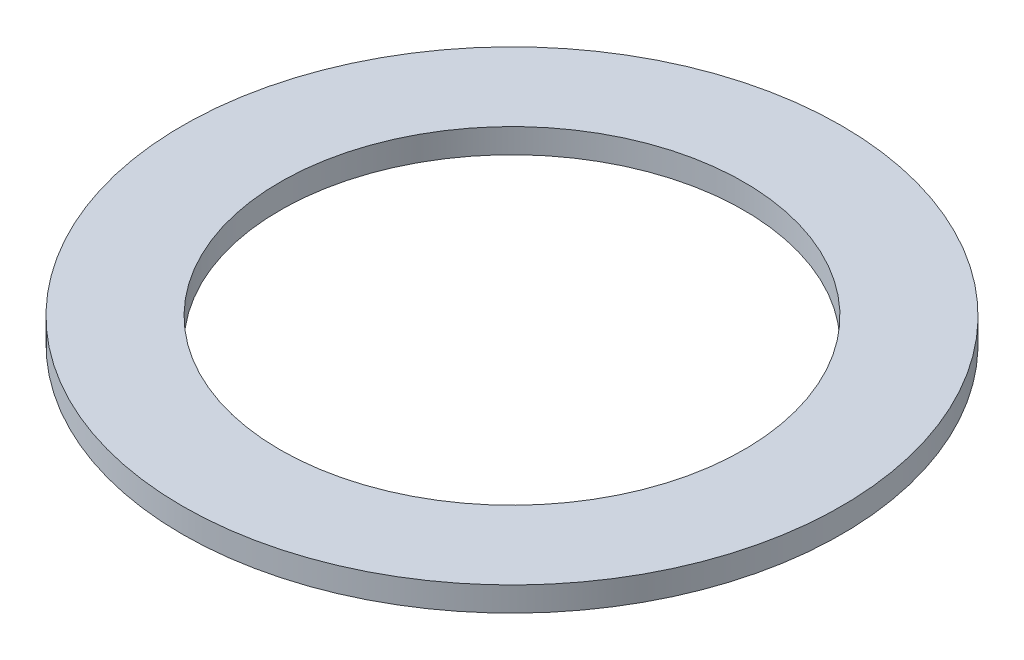
ISO-10303-21;
HEADER;
FILE_DESCRIPTION(('STEP AP214'),'2;1');
FILE_NAME('part.step','',(''),(''),'','','');
FILE_SCHEMA(('AUTOMOTIVE_DESIGN { 1 0 10303 214 1 1 1 1 }'));
ENDSEC;
DATA;
#1=APPLICATION_CONTEXT('core data for automotive mechanical design processes');
#2=APPLICATION_PROTOCOL_DEFINITION('international standard','automotive_design',2000,#1);
#3=PRODUCT_CONTEXT('',#1,'mechanical');
#4=PRODUCT('Part','Part','',(#3));
#5=PRODUCT_RELATED_PRODUCT_CATEGORY('part','',(#4));
#6=PRODUCT_DEFINITION_FORMATION('','',#4);
#7=PRODUCT_DEFINITION_CONTEXT('part definition',#1,'design');
#8=PRODUCT_DEFINITION('design','',#6,#7);
#9=PRODUCT_DEFINITION_SHAPE('','',#8);
#10=(LENGTH_UNIT() NAMED_UNIT(*) SI_UNIT(.MILLI.,.METRE.));
#11=(NAMED_UNIT(*) PLANE_ANGLE_UNIT() SI_UNIT($,.RADIAN.));
#12=(NAMED_UNIT(*) SI_UNIT($,.STERADIAN.) SOLID_ANGLE_UNIT());
#13=UNCERTAINTY_MEASURE_WITH_UNIT(LENGTH_MEASURE(1.E-05),#10,'distance_accuracy_value','');
#14=(GEOMETRIC_REPRESENTATION_CONTEXT(3) GLOBAL_UNCERTAINTY_ASSIGNED_CONTEXT((#13)) GLOBAL_UNIT_ASSIGNED_CONTEXT((#10,
#11,#12)) REPRESENTATION_CONTEXT('',''));
#15=CARTESIAN_POINT('',(0.,0.,0.));
#16=DIRECTION('',(0.,0.,1.));
#17=DIRECTION('',(1.,0.,0.));
#18=AXIS2_PLACEMENT_3D('',#15,#16,#17);
#19=CARTESIAN_POINT('',(0.,1.524,0.));
#20=DIRECTION('',(0.,1.,0.));
#21=DIRECTION('',(0.,0.,1.));
#22=AXIS2_PLACEMENT_3D('',#19,#20,#21);
#23=PLANE('',#22);
#24=CARTESIAN_POINT('',(0.,1.524,0.));
#25=DIRECTION('',(0.,1.,0.));
#26=DIRECTION('',(0.,0.,1.));
#27=AXIS2_PLACEMENT_3D('',#24,#25,#26);
#28=CIRCLE('',#27,20.574);
#29=CARTESIAN_POINT('',(0.,1.524,20.574));
#30=VERTEX_POINT('',#29);
#31=EDGE_CURVE('E10',#30,#30,#28,.T.);
#32=ORIENTED_EDGE('',*,*,#31,.T.);
#33=EDGE_LOOP('',(#32));
#34=FACE_BOUND('',#33,.T.);
#35=CARTESIAN_POINT('',(0.,1.524,0.));
#36=DIRECTION('',(0.,1.,0.));
#37=DIRECTION('',(0.,0.,1.));
#38=AXIS2_PLACEMENT_3D('',#35,#36,#37);
#39=CIRCLE('',#38,14.478);
#40=CARTESIAN_POINT('',(0.,1.524,14.478));
#41=VERTEX_POINT('',#40);
#42=EDGE_CURVE('E43',#41,#41,#39,.T.);
#43=ORIENTED_EDGE('',*,*,#42,.F.);
#44=EDGE_LOOP('',(#43));
#45=FACE_BOUND('',#44,.T.);
#46=ADVANCED_FACE('F32',(#34,#45),#23,.T.);
#47=CARTESIAN_POINT('',(0.,0.,0.));
#48=DIRECTION('',(0.,1.,0.));
#49=DIRECTION('',(0.,0.,1.));
#50=AXIS2_PLACEMENT_3D('',#47,#48,#49);
#51=PLANE('',#50);
#52=CARTESIAN_POINT('',(0.,0.,0.));
#53=DIRECTION('',(0.,1.,0.));
#54=DIRECTION('',(0.,0.,1.));
#55=AXIS2_PLACEMENT_3D('',#52,#53,#54);
#56=CIRCLE('',#55,20.574);
#57=CARTESIAN_POINT('',(0.,0.,20.574));
#58=VERTEX_POINT('',#57);
#59=EDGE_CURVE('E39',#58,#58,#56,.T.);
#60=ORIENTED_EDGE('',*,*,#59,.F.);
#61=EDGE_LOOP('',(#60));
#62=FACE_BOUND('',#61,.T.);
#63=CARTESIAN_POINT('',(0.,0.,0.));
#64=DIRECTION('',(0.,1.,0.));
#65=DIRECTION('',(0.,0.,1.));
#66=AXIS2_PLACEMENT_3D('',#63,#64,#65);
#67=CIRCLE('',#66,14.478);
#68=CARTESIAN_POINT('',(0.,0.,14.478));
#69=VERTEX_POINT('',#68);
#70=EDGE_CURVE('E47',#69,#69,#67,.T.);
#71=ORIENTED_EDGE('',*,*,#70,.T.);
#72=EDGE_LOOP('',(#71));
#73=FACE_BOUND('',#72,.T.);
#74=ADVANCED_FACE('F53',(#62,#73),#51,.F.);
#75=CARTESIAN_POINT('',(0.,1.524,0.));
#76=DIRECTION('',(0.,-1.,0.));
#77=DIRECTION('',(0.,0.,-1.));
#78=AXIS2_PLACEMENT_3D('',#75,#76,#77);
#79=CYLINDRICAL_SURFACE('',#78,20.574);
#80=ORIENTED_EDGE('',*,*,#31,.F.);
#81=EDGE_LOOP('',(#80));
#82=FACE_BOUND('',#81,.T.);
#83=ORIENTED_EDGE('',*,*,#59,.T.);
#84=EDGE_LOOP('',(#83));
#85=FACE_BOUND('',#84,.T.);
#86=ADVANCED_FACE('F34',(#82,#85),#79,.T.);
#87=CARTESIAN_POINT('',(0.,1.524,0.));
#88=DIRECTION('',(0.,-1.,0.));
#89=DIRECTION('',(0.,0.,-1.));
#90=AXIS2_PLACEMENT_3D('',#87,#88,#89);
#91=CYLINDRICAL_SURFACE('',#90,14.478);
#92=ORIENTED_EDGE('',*,*,#42,.T.);
#93=EDGE_LOOP('',(#92));
#94=FACE_BOUND('',#93,.T.);
#95=ORIENTED_EDGE('',*,*,#70,.F.);
#96=EDGE_LOOP('',(#95));
#97=FACE_BOUND('',#96,.T.);
#98=ADVANCED_FACE('F55',(#94,#97),#91,.F.);
#99=CLOSED_SHELL('',(#46,#74,#86,#98));
#100=MANIFOLD_SOLID_BREP('B2',#99);
#101=ADVANCED_BREP_SHAPE_REPRESENTATION('',(#18,#100),#14);
#102=SHAPE_DEFINITION_REPRESENTATION(#9,#101);
ENDSEC;
END-ISO-10303-21;
